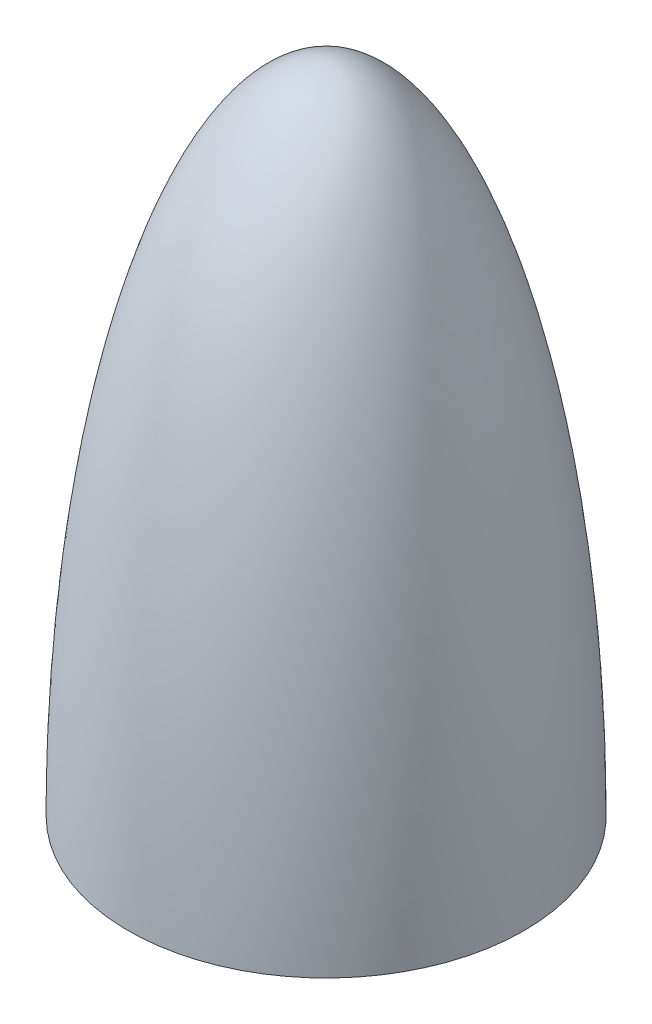
ISO-10303-21;
HEADER;
FILE_DESCRIPTION(('STEP AP214'),'2;1');
FILE_NAME('part.step','',(''),(''),'','','');
FILE_SCHEMA(('AUTOMOTIVE_DESIGN { 1 0 10303 214 1 1 1 1 }'));
ENDSEC;
DATA;
#1=APPLICATION_CONTEXT('core data for automotive mechanical design processes');
#2=APPLICATION_PROTOCOL_DEFINITION('international standard','automotive_design',2000,#1);
#3=PRODUCT_CONTEXT('',#1,'mechanical');
#4=PRODUCT('Part','Part','',(#3));
#5=PRODUCT_RELATED_PRODUCT_CATEGORY('part','',(#4));
#6=PRODUCT_DEFINITION_FORMATION('','',#4);
#7=PRODUCT_DEFINITION_CONTEXT('part definition',#1,'design');
#8=PRODUCT_DEFINITION('design','',#6,#7);
#9=PRODUCT_DEFINITION_SHAPE('','',#8);
#10=(LENGTH_UNIT() NAMED_UNIT(*) SI_UNIT(.MILLI.,.METRE.));
#11=(NAMED_UNIT(*) PLANE_ANGLE_UNIT() SI_UNIT($,.RADIAN.));
#12=(NAMED_UNIT(*) SI_UNIT($,.STERADIAN.) SOLID_ANGLE_UNIT());
#13=UNCERTAINTY_MEASURE_WITH_UNIT(LENGTH_MEASURE(1.E-05),#10,'distance_accuracy_value','');
#14=(GEOMETRIC_REPRESENTATION_CONTEXT(3) GLOBAL_UNCERTAINTY_ASSIGNED_CONTEXT((#13)) GLOBAL_UNIT_ASSIGNED_CONTEXT((#10,
#11,#12)) REPRESENTATION_CONTEXT('',''));
#15=CARTESIAN_POINT('',(0.,0.,0.));
#16=DIRECTION('',(0.,0.,1.));
#17=DIRECTION('',(1.,0.,0.));
#18=AXIS2_PLACEMENT_3D('',#15,#16,#17);
#19=CARTESIAN_POINT('',(0.,-6.55550613792855E-09,0.));
#20=DIRECTION('',(0.,1.,0.));
#21=DIRECTION('',(0.,0.,1.));
#22=AXIS2_PLACEMENT_3D('',#19,#20,#21);
#23=PLANE('',#22);
#24=CARTESIAN_POINT('',(0.,-6.55550613792855E-09,0.));
#25=DIRECTION('',(0.,-1.,0.));
#26=DIRECTION('',(0.,0.,-1.));
#27=AXIS2_PLACEMENT_3D('',#24,#25,#26);
#28=CIRCLE('',#27,51.1047999961505);
#29=CARTESIAN_POINT('',(0.,-6.55550613792855E-09,-51.1047999961505));
#30=VERTEX_POINT('',#29);
#31=EDGE_CURVE('E13',#30,#30,#28,.T.);
#32=ORIENTED_EDGE('',*,*,#31,.T.);
#33=EDGE_LOOP('',(#32));
#34=FACE_BOUND('',#33,.T.);
#35=CARTESIAN_POINT('',(0.,-6.50549059066918E-09,0.));
#36=DIRECTION('',(0.,-1.,0.));
#37=DIRECTION('',(1.,0.,0.));
#38=AXIS2_PLACEMENT_3D('',#35,#36,#37);
#39=CIRCLE('',#38,49.5299999961505);
#40=CARTESIAN_POINT('',(49.5299999961505,-6.50548254135366E-09,0.));
#41=VERTEX_POINT('',#40);
#42=EDGE_CURVE('E57',#41,#41,#39,.T.);
#43=ORIENTED_EDGE('',*,*,#42,.F.);
#44=EDGE_LOOP('',(#43));
#45=FACE_BOUND('',#44,.T.);
#46=ADVANCED_FACE('F46',(#34,#45),#23,.F.);
#47=CARTESIAN_POINT('',(51.1047999961505,-6.55549719326062E-09,0.));
#48=CARTESIAN_POINT('',(51.1047999961735,0.724272392955788,0.));
#49=CARTESIAN_POINT('',(51.1017991634352,2.14269038264369,0.));
#50=CARTESIAN_POINT('',(51.0882952933681,4.9634524644603,0.));
#51=CARTESIAN_POINT('',(51.0522684039913,7.77222815910635,0.));
#52=CARTESIAN_POINT('',(50.9981861786007,11.1397064487684,0.));
#53=CARTESIAN_POINT('',(50.9259983018497,14.175675916918,0.));
#54=CARTESIAN_POINT('',(50.8356371492209,17.4128974940117,0.));
#55=CARTESIAN_POINT('',(50.7405951946471,20.130047683669,0.));
#56=CARTESIAN_POINT('',(50.6476548999382,22.5222287010843,0.));
#57=CARTESIAN_POINT('',(50.5454886713452,24.8807132879079,0.));
#58=CARTESIAN_POINT('',(50.434063561965,27.2538615085486,0.));
#59=CARTESIAN_POINT('',(50.2904891347137,30.0130905623415,0.));
#60=CARTESIAN_POINT('',(50.107621218274,33.1701900691576,0.));
#61=CARTESIAN_POINT('',(49.8553347081114,37.1126074400005,0.));
#62=CARTESIAN_POINT('',(49.5142619840595,41.8422049269887,0.));
#63=CARTESIAN_POINT('',(49.0594758911712,47.3549779956067,0.));
#64=CARTESIAN_POINT('',(48.4595514217384,53.6486331152758,0.));
#65=CARTESIAN_POINT('',(47.776866163025,59.9336179327746,0.));
#66=CARTESIAN_POINT('',(47.0083109068537,66.2088338575887,0.));
#67=CARTESIAN_POINT('',(46.1502487155653,72.4723858317684,0.));
#68=CARTESIAN_POINT('',(45.1983152512175,78.7224141625598,0.));
#69=CARTESIAN_POINT('',(43.8847408393388,86.5151537778926,0.));
#70=CARTESIAN_POINT('',(42.098311141981,95.8292262164565,0.));
#71=CARTESIAN_POINT('',(40.0224870569238,105.084670910299,0.));
#72=CARTESIAN_POINT('',(37.6054315068634,114.256524146734,0.));
#73=CARTESIAN_POINT('',(34.8689318669911,123.337298353736,0.));
#74=CARTESIAN_POINT('',(32.1567267837672,131.190325878624,0.));
#75=CARTESIAN_POINT('',(29.0403033513679,138.8964931118,0.));
#76=CARTESIAN_POINT('',(25.4020366144865,146.334350780714,0.));
#77=CARTESIAN_POINT('',(22.3096768864853,151.675942334512,0.));
#78=CARTESIAN_POINT('',(19.4083200920236,155.921887320728,0.));
#79=CARTESIAN_POINT('',(16.6627654800015,159.297376115462,0.));
#80=CARTESIAN_POINT('',(14.2799015067394,161.77549197685,0.));
#81=CARTESIAN_POINT('',(12.060922047289,163.708213835528,0.));
#82=CARTESIAN_POINT('',(10.050656578654,165.163933334792,0.));
#83=CARTESIAN_POINT('',(8.1716453288429,166.281299655514,0.));
#84=CARTESIAN_POINT('',(6.36559729624706,167.134045435552,0.));
#85=CARTESIAN_POINT('',(4.60587249329145,167.758465241892,0.));
#86=CARTESIAN_POINT('',(2.78723827875148,168.1947815064,0.));
#87=CARTESIAN_POINT('',(1.42134579560994,168.362507149137,0.));
#88=CARTESIAN_POINT('',(0.497156327282562,168.401943622607,0.));
#89=CARTESIAN_POINT('',(1.49700083508886E-09,168.401999995067,0.));
#90=B_SPLINE_CURVE_WITH_KNOTS('',4,(#47,#48,#49,#50,#51,#52,#53,#54,#55,#56,#57,#58,#59,#60,#61,
#62,#63,#64,#65,#66,#67,#68,#69,#70,#71,#72,#73,#74,#75,#76,#77,#78,#79,#80,#81,#82,#83,#84,#85,
#86,#87,#88,#89),.UNSPECIFIED.,.F.,.F.,(5,1,1,1,1,1,1,1,1,1,1,1,1,1,1,1,1,1,1,1,1,1,1,1,1,1,1,1,
1,1,1,1,1,1,1,1,1,1,1,5),(0.0834679898929717,0.0991326130909195,0.114797236322158,
0.130461859553396,0.146126482784635,0.161791106173589,0.177455729562543,0.193120352951498,
0.200952664645975,0.208784976340452,0.224449599589218,0.240114222837983,0.255778846086749,
0.271443469335514,0.302772715219342,0.334101961103169,0.365431207241284,0.396760453379398,
0.428089700760094,0.45941894814079,0.49074819200976,0.52207743587873,0.584735925337255,
0.647394415208665,0.678723666104373,0.710052917000081,0.772711358903061,0.812029381689221,
0.843358528634521,0.874069919091687,0.8949560029859,0.913855175590417,0.92951826769698,
0.942132583141838,0.953210825430379,0.962991193519718,0.972793201649132,0.981662050689433,
0.990155933843362,1.),.UNSPECIFIED.);
#91=CARTESIAN_POINT('',(0.,168.402,0.));
#92=DIRECTION('',(0.,-1.,0.));
#93=AXIS1_PLACEMENT('',#91,#92);
#94=SURFACE_OF_REVOLUTION('',#90,#93);
#95=CARTESIAN_POINT('',(1.49700083508886E-09,168.401999995067,0.));
#96=VERTEX_POINT('',#95);
#97=VERTEX_LOOP('',#96);
#98=FACE_BOUND('',#97,.T.);
#99=ORIENTED_EDGE('',*,*,#31,.F.);
#100=EDGE_LOOP('',(#99));
#101=FACE_BOUND('',#100,.T.);
#102=ADVANCED_FACE('F66',(#98,#101),#94,.F.);
#103=CARTESIAN_POINT('',(51.1047999961505,-6.55549719326062E-09,0.));
#104=CARTESIAN_POINT('',(51.1047999961735,0.724272392955788,0.));
#105=CARTESIAN_POINT('',(51.1017991634352,2.14269038264369,0.));
#106=CARTESIAN_POINT('',(51.0882952933681,4.9634524644603,0.));
#107=CARTESIAN_POINT('',(51.0522684039913,7.77222815910635,0.));
#108=CARTESIAN_POINT('',(50.9981861786007,11.1397064487684,0.));
#109=CARTESIAN_POINT('',(50.9259983018497,14.175675916918,0.));
#110=CARTESIAN_POINT('',(50.8356371492209,17.4128974940117,0.));
#111=CARTESIAN_POINT('',(50.7405951946471,20.130047683669,0.));
#112=CARTESIAN_POINT('',(50.6476548999382,22.5222287010843,0.));
#113=CARTESIAN_POINT('',(50.5454886713452,24.8807132879079,0.));
#114=CARTESIAN_POINT('',(50.434063561965,27.2538615085486,0.));
#115=CARTESIAN_POINT('',(50.2904891347137,30.0130905623415,0.));
#116=CARTESIAN_POINT('',(50.107621218274,33.1701900691576,0.));
#117=CARTESIAN_POINT('',(49.8553347081114,37.1126074400005,0.));
#118=CARTESIAN_POINT('',(49.5142619840595,41.8422049269887,0.));
#119=CARTESIAN_POINT('',(49.0594758911712,47.3549779956067,0.));
#120=CARTESIAN_POINT('',(48.4595514217384,53.6486331152758,0.));
#121=CARTESIAN_POINT('',(47.776866163025,59.9336179327746,0.));
#122=CARTESIAN_POINT('',(47.0083109068537,66.2088338575887,0.));
#123=CARTESIAN_POINT('',(46.1502487155653,72.4723858317684,0.));
#124=CARTESIAN_POINT('',(45.1983152512175,78.7224141625598,0.));
#125=CARTESIAN_POINT('',(43.8847408393388,86.5151537778926,0.));
#126=CARTESIAN_POINT('',(42.098311141981,95.8292262164565,0.));
#127=CARTESIAN_POINT('',(40.0224870569238,105.084670910299,0.));
#128=CARTESIAN_POINT('',(37.6054315068634,114.256524146734,0.));
#129=CARTESIAN_POINT('',(34.8689318669911,123.337298353736,0.));
#130=CARTESIAN_POINT('',(32.1567267837672,131.190325878624,0.));
#131=CARTESIAN_POINT('',(29.0403033513679,138.8964931118,0.));
#132=CARTESIAN_POINT('',(25.4020366144865,146.334350780714,0.));
#133=CARTESIAN_POINT('',(22.3096768864853,151.675942334512,0.));
#134=CARTESIAN_POINT('',(19.4083200920236,155.921887320728,0.));
#135=CARTESIAN_POINT('',(16.6627654800015,159.297376115462,0.));
#136=CARTESIAN_POINT('',(14.2799015067394,161.77549197685,0.));
#137=CARTESIAN_POINT('',(12.060922047289,163.708213835528,0.));
#138=CARTESIAN_POINT('',(10.050656578654,165.163933334792,0.));
#139=CARTESIAN_POINT('',(8.1716453288429,166.281299655514,0.));
#140=CARTESIAN_POINT('',(6.36559729624706,167.134045435552,0.));
#141=CARTESIAN_POINT('',(4.60587249329145,167.758465241892,0.));
#142=CARTESIAN_POINT('',(2.78728658987235,168.194769915874,0.));
#143=CARTESIAN_POINT('',(1.42144450892628,168.362495027368,0.));
#144=CARTESIAN_POINT('',(0.497304968155919,168.401937279254,0.));
#145=CARTESIAN_POINT('',(0.000198604191915599,168.401999971284,0.));
#146=B_SPLINE_CURVE_WITH_KNOTS('',4,(#103,#104,#105,#106,#107,#108,#109,#110,#111,#112,#113,
#114,#115,#116,#117,#118,#119,#120,#121,#122,#123,#124,#125,#126,#127,#128,#129,#130,#131,#132,
#133,#134,#135,#136,#137,#138,#139,#140,#141,#142,#143,#144,#145),.UNSPECIFIED.,.F.,.F.,(5,1,1,
1,1,1,1,1,1,1,1,1,1,1,1,1,1,1,1,1,1,1,1,1,1,1,1,1,1,1,1,1,1,1,1,1,1,1,1,5),(0.0834679898929717,
0.0991326130909195,0.114797236322158,0.130461859553396,0.146126482784635,0.161791106173589,
0.177455729562543,0.193120352951498,0.200952664645975,0.208784976340452,0.224449599589218,
0.240114222837983,0.255778846086749,0.271443469335514,0.302772715219342,0.334101961103169,
0.365431207241284,0.396760453379398,0.428089700760094,0.45941894814079,0.49074819200976,
0.52207743587873,0.584735925337255,0.647394415208665,0.678723666104373,0.710052917000081,
0.772711358903061,0.812029381689221,0.843358528634521,0.874069919091687,0.8949560029859,
0.913855175590417,0.92951826769698,0.942132583141838,0.953210825430379,0.962991193519718,
0.972793201649132,0.981662050689433,0.990155933843362,0.99999901687931),.UNSPECIFIED.);
#147=CARTESIAN_POINT('',(0.,168.402,0.));
#148=DIRECTION('',(0.,-1.,0.));
#149=AXIS1_PLACEMENT('',#147,#148);
#150=SURFACE_OF_REVOLUTION('',#146,#149);
#151=OFFSET_SURFACE('',#150,1.5748,.F.);
#152=CARTESIAN_POINT('',(1.42596170255469E-13,166.827199983807,0.));
#153=VERTEX_POINT('',#152);
#154=VERTEX_LOOP('',#153);
#155=FACE_BOUND('',#154,.T.);
#156=ORIENTED_EDGE('',*,*,#42,.T.);
#157=EDGE_LOOP('',(#156));
#158=FACE_BOUND('',#157,.T.);
#159=ADVANCED_FACE('F63',(#155,#158),#151,.T.);
#160=CLOSED_SHELL('',(#46,#102,#159));
#161=MANIFOLD_SOLID_BREP('B2',#160);
#162=ADVANCED_BREP_SHAPE_REPRESENTATION('',(#18,#161),#14);
#163=SHAPE_DEFINITION_REPRESENTATION(#9,#162);
ENDSEC;
END-ISO-10303-21;
